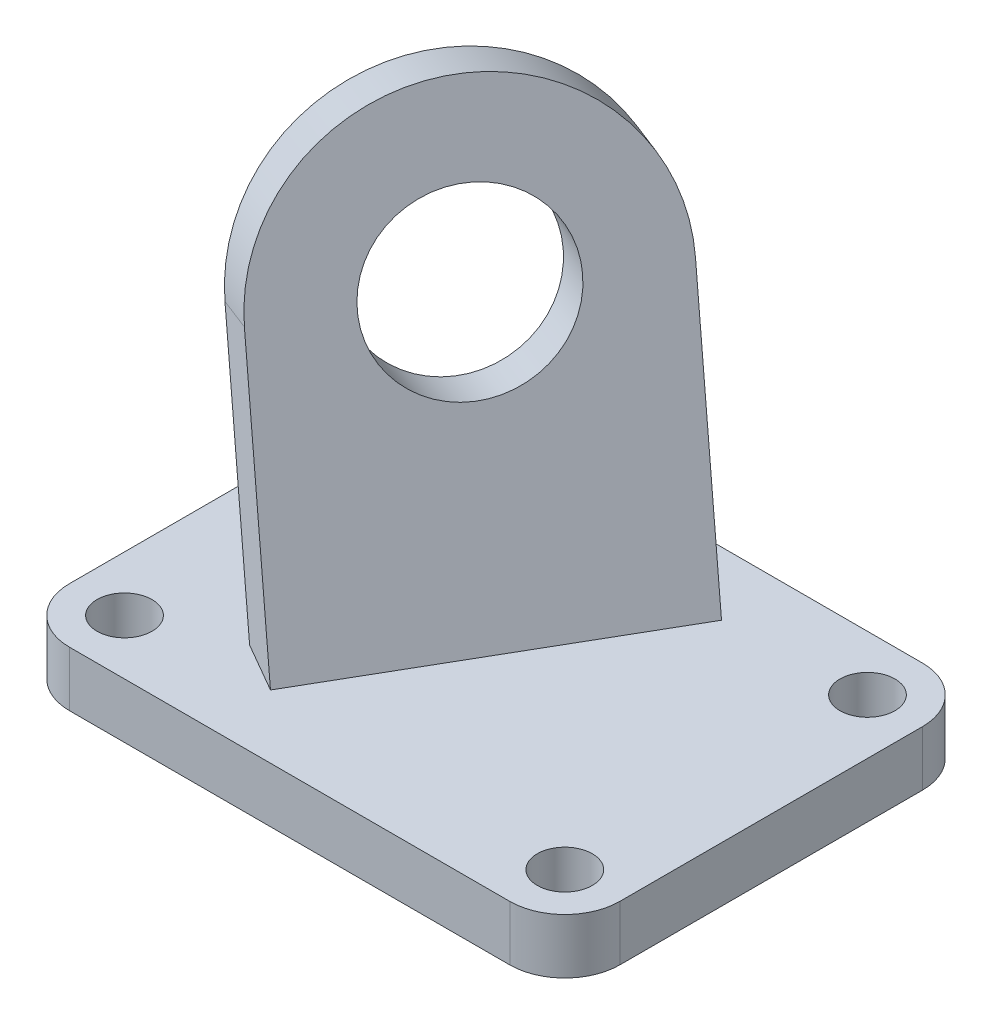
ISO-10303-21;
HEADER;
FILE_DESCRIPTION(('STEP AP214'),'2;1');
FILE_NAME('part.step','',(''),(''),'','','');
FILE_SCHEMA(('AUTOMOTIVE_DESIGN { 1 0 10303 214 1 1 1 1 }'));
ENDSEC;
DATA;
#1=APPLICATION_CONTEXT('core data for automotive mechanical design processes');
#2=APPLICATION_PROTOCOL_DEFINITION('international standard','automotive_design',2000,#1);
#3=PRODUCT_CONTEXT('',#1,'mechanical');
#4=PRODUCT('Part','Part','',(#3));
#5=PRODUCT_RELATED_PRODUCT_CATEGORY('part','',(#4));
#6=PRODUCT_DEFINITION_FORMATION('','',#4);
#7=PRODUCT_DEFINITION_CONTEXT('part definition',#1,'design');
#8=PRODUCT_DEFINITION('design','',#6,#7);
#9=PRODUCT_DEFINITION_SHAPE('','',#8);
#10=(LENGTH_UNIT() NAMED_UNIT(*) SI_UNIT(.MILLI.,.METRE.));
#11=(NAMED_UNIT(*) PLANE_ANGLE_UNIT() SI_UNIT($,.RADIAN.));
#12=(NAMED_UNIT(*) SI_UNIT($,.STERADIAN.) SOLID_ANGLE_UNIT());
#13=UNCERTAINTY_MEASURE_WITH_UNIT(LENGTH_MEASURE(1.E-05),#10,'distance_accuracy_value','');
#14=(GEOMETRIC_REPRESENTATION_CONTEXT(3) GLOBAL_UNCERTAINTY_ASSIGNED_CONTEXT((#13)) GLOBAL_UNIT_ASSIGNED_CONTEXT((#10,
#11,#12)) REPRESENTATION_CONTEXT('',''));
#15=CARTESIAN_POINT('',(0.,0.,0.));
#16=DIRECTION('',(0.,0.,1.));
#17=DIRECTION('',(1.,0.,0.));
#18=AXIS2_PLACEMENT_3D('',#15,#16,#17);
#19=CARTESIAN_POINT('',(-40.,-10.,-27.5));
#20=DIRECTION('',(0.,1.,0.));
#21=DIRECTION('',(0.,0.,1.));
#22=AXIS2_PLACEMENT_3D('',#19,#20,#21);
#23=CYLINDRICAL_SURFACE('',#22,10.);
#24=CARTESIAN_POINT('',(-40.,0.,-27.5));
#25=DIRECTION('',(0.,1.,0.));
#26=DIRECTION('',(0.,0.,-1.));
#27=AXIS2_PLACEMENT_3D('',#24,#25,#26);
#28=CIRCLE('',#27,10.);
#29=CARTESIAN_POINT('',(-39.9999999999999,0.,-37.5));
#30=VERTEX_POINT('',#29);
#31=CARTESIAN_POINT('',(-50.,0.,-27.4999999999999));
#32=VERTEX_POINT('',#31);
#33=EDGE_CURVE('E177',#30,#32,#28,.T.);
#34=ORIENTED_EDGE('',*,*,#33,.F.);
#35=DIRECTION('',(0.,1.,0.));
#36=VECTOR('',#35,1.);
#37=CARTESIAN_POINT('',(-39.9999999999999,-10.,-37.5));
#38=LINE('',#37,#36);
#39=CARTESIAN_POINT('',(-39.9999999999999,-10.,-37.5));
#40=VERTEX_POINT('',#39);
#41=EDGE_CURVE('E228',#40,#30,#38,.T.);
#42=ORIENTED_EDGE('',*,*,#41,.F.);
#43=CARTESIAN_POINT('',(-40.,-10.,-27.5));
#44=DIRECTION('',(0.,1.,0.));
#45=DIRECTION('',(0.,0.,-1.));
#46=AXIS2_PLACEMENT_3D('',#43,#44,#45);
#47=CIRCLE('',#46,10.);
#48=CARTESIAN_POINT('',(-50.,-10.,-27.4999999999999));
#49=VERTEX_POINT('',#48);
#50=EDGE_CURVE('E180',#40,#49,#47,.T.);
#51=ORIENTED_EDGE('',*,*,#50,.T.);
#52=DIRECTION('',(0.,1.,0.));
#53=VECTOR('',#52,1.);
#54=CARTESIAN_POINT('',(-50.,-10.,-27.4999999999999));
#55=LINE('',#54,#53);
#56=EDGE_CURVE('E205',#49,#32,#55,.T.);
#57=ORIENTED_EDGE('',*,*,#56,.T.);
#58=EDGE_LOOP('',(#34,#42,#51,#57));
#59=FACE_BOUND('',#58,.T.);
#60=ADVANCED_FACE('F33',(#59),#23,.T.);
#61=CARTESIAN_POINT('',(-39.9999999999999,-10.,-37.5));
#62=DIRECTION('',(0.,0.,-1.));
#63=DIRECTION('',(-1.,0.,0.));
#64=AXIS2_PLACEMENT_3D('',#61,#62,#63);
#65=PLANE('',#64);
#66=DIRECTION('',(-1.,0.,0.));
#67=VECTOR('',#66,1.);
#68=CARTESIAN_POINT('',(-39.9999999999999,0.,-37.5));
#69=LINE('',#68,#67);
#70=CARTESIAN_POINT('',(39.9999999999999,0.,-37.5));
#71=VERTEX_POINT('',#70);
#72=EDGE_CURVE('E184',#71,#30,#69,.T.);
#73=ORIENTED_EDGE('',*,*,#72,.F.);
#74=DIRECTION('',(0.,1.,0.));
#75=VECTOR('',#74,1.);
#76=CARTESIAN_POINT('',(39.9999999999999,-10.,-37.5));
#77=LINE('',#76,#75);
#78=CARTESIAN_POINT('',(39.9999999999999,-10.,-37.5));
#79=VERTEX_POINT('',#78);
#80=EDGE_CURVE('E230',#79,#71,#77,.T.);
#81=ORIENTED_EDGE('',*,*,#80,.F.);
#82=DIRECTION('',(-1.,0.,0.));
#83=VECTOR('',#82,1.);
#84=CARTESIAN_POINT('',(-39.9999999999999,-10.,-37.5));
#85=LINE('',#84,#83);
#86=EDGE_CURVE('E202',#79,#40,#85,.T.);
#87=ORIENTED_EDGE('',*,*,#86,.T.);
#88=ORIENTED_EDGE('',*,*,#41,.T.);
#89=EDGE_LOOP('',(#73,#81,#87,#88));
#90=FACE_BOUND('',#89,.T.);
#91=ADVANCED_FACE('F256',(#90),#65,.T.);
#92=CARTESIAN_POINT('',(40.,-10.,-27.5));
#93=DIRECTION('',(0.,1.,0.));
#94=DIRECTION('',(0.,0.,1.));
#95=AXIS2_PLACEMENT_3D('',#92,#93,#94);
#96=CYLINDRICAL_SURFACE('',#95,10.);
#97=CARTESIAN_POINT('',(40.,0.,-27.5));
#98=DIRECTION('',(0.,1.,0.));
#99=DIRECTION('',(0.,0.,1.));
#100=AXIS2_PLACEMENT_3D('',#97,#98,#99);
#101=CIRCLE('',#100,10.);
#102=CARTESIAN_POINT('',(50.,0.,-27.4999999999999));
#103=VERTEX_POINT('',#102);
#104=EDGE_CURVE('E223',#103,#71,#101,.T.);
#105=ORIENTED_EDGE('',*,*,#104,.F.);
#106=DIRECTION('',(0.,1.,0.));
#107=VECTOR('',#106,1.);
#108=CARTESIAN_POINT('',(50.,-10.,-27.4999999999999));
#109=LINE('',#108,#107);
#110=CARTESIAN_POINT('',(50.,-10.,-27.4999999999999));
#111=VERTEX_POINT('',#110);
#112=EDGE_CURVE('E232',#111,#103,#109,.T.);
#113=ORIENTED_EDGE('',*,*,#112,.F.);
#114=CARTESIAN_POINT('',(40.,-10.,-27.5));
#115=DIRECTION('',(0.,1.,0.));
#116=DIRECTION('',(0.,0.,1.));
#117=AXIS2_PLACEMENT_3D('',#114,#115,#116);
#118=CIRCLE('',#117,10.);
#119=EDGE_CURVE('E199',#111,#79,#118,.T.);
#120=ORIENTED_EDGE('',*,*,#119,.T.);
#121=ORIENTED_EDGE('',*,*,#80,.T.);
#122=EDGE_LOOP('',(#105,#113,#120,#121));
#123=FACE_BOUND('',#122,.T.);
#124=ADVANCED_FACE('F277',(#123),#96,.T.);
#125=CARTESIAN_POINT('',(50.,-10.,27.4999999999999));
#126=DIRECTION('',(1.,0.,0.));
#127=DIRECTION('',(0.,0.,-1.));
#128=AXIS2_PLACEMENT_3D('',#125,#126,#127);
#129=PLANE('',#128);
#130=DIRECTION('',(0.,0.,-1.));
#131=VECTOR('',#130,1.);
#132=CARTESIAN_POINT('',(50.,0.,27.4999999999999));
#133=LINE('',#132,#131);
#134=CARTESIAN_POINT('',(50.,0.,27.4999999999999));
#135=VERTEX_POINT('',#134);
#136=EDGE_CURVE('E220',#135,#103,#133,.T.);
#137=ORIENTED_EDGE('',*,*,#136,.F.);
#138=DIRECTION('',(0.,1.,0.));
#139=VECTOR('',#138,1.);
#140=CARTESIAN_POINT('',(50.,-10.,27.4999999999999));
#141=LINE('',#140,#139);
#142=CARTESIAN_POINT('',(50.,-10.,27.4999999999999));
#143=VERTEX_POINT('',#142);
#144=EDGE_CURVE('E234',#143,#135,#141,.T.);
#145=ORIENTED_EDGE('',*,*,#144,.F.);
#146=DIRECTION('',(0.,0.,-1.));
#147=VECTOR('',#146,1.);
#148=CARTESIAN_POINT('',(50.,-10.,27.4999999999999));
#149=LINE('',#148,#147);
#150=EDGE_CURVE('E196',#143,#111,#149,.T.);
#151=ORIENTED_EDGE('',*,*,#150,.T.);
#152=ORIENTED_EDGE('',*,*,#112,.T.);
#153=EDGE_LOOP('',(#137,#145,#151,#152));
#154=FACE_BOUND('',#153,.T.);
#155=ADVANCED_FACE('F275',(#154),#129,.T.);
#156=CARTESIAN_POINT('',(40.,-10.,27.5));
#157=DIRECTION('',(0.,1.,0.));
#158=DIRECTION('',(0.,0.,1.));
#159=AXIS2_PLACEMENT_3D('',#156,#157,#158);
#160=CYLINDRICAL_SURFACE('',#159,10.);
#161=CARTESIAN_POINT('',(40.,0.,27.5));
#162=DIRECTION('',(0.,1.,0.));
#163=DIRECTION('',(0.,0.,-1.));
#164=AXIS2_PLACEMENT_3D('',#161,#162,#163);
#165=CIRCLE('',#164,10.);
#166=CARTESIAN_POINT('',(39.9999999999999,0.,37.5));
#167=VERTEX_POINT('',#166);
#168=EDGE_CURVE('E217',#167,#135,#165,.T.);
#169=ORIENTED_EDGE('',*,*,#168,.F.);
#170=DIRECTION('',(0.,1.,0.));
#171=VECTOR('',#170,1.);
#172=CARTESIAN_POINT('',(39.9999999999999,-10.,37.5));
#173=LINE('',#172,#171);
#174=CARTESIAN_POINT('',(39.9999999999999,-10.,37.5));
#175=VERTEX_POINT('',#174);
#176=EDGE_CURVE('E236',#175,#167,#173,.T.);
#177=ORIENTED_EDGE('',*,*,#176,.F.);
#178=CARTESIAN_POINT('',(40.,-10.,27.5));
#179=DIRECTION('',(0.,1.,0.));
#180=DIRECTION('',(0.,0.,-1.));
#181=AXIS2_PLACEMENT_3D('',#178,#179,#180);
#182=CIRCLE('',#181,10.);
#183=EDGE_CURVE('E193',#175,#143,#182,.T.);
#184=ORIENTED_EDGE('',*,*,#183,.T.);
#185=ORIENTED_EDGE('',*,*,#144,.T.);
#186=EDGE_LOOP('',(#169,#177,#184,#185));
#187=FACE_BOUND('',#186,.T.);
#188=ADVANCED_FACE('F271',(#187),#160,.T.);
#189=CARTESIAN_POINT('',(-39.9999999999999,-10.,37.5));
#190=DIRECTION('',(0.,0.,1.));
#191=DIRECTION('',(1.,0.,0.));
#192=AXIS2_PLACEMENT_3D('',#189,#190,#191);
#193=PLANE('',#192);
#194=DIRECTION('',(1.,0.,0.));
#195=VECTOR('',#194,1.);
#196=CARTESIAN_POINT('',(-39.9999999999999,0.,37.5));
#197=LINE('',#196,#195);
#198=CARTESIAN_POINT('',(-39.9999999999999,0.,37.5));
#199=VERTEX_POINT('',#198);
#200=EDGE_CURVE('E214',#199,#167,#197,.T.);
#201=ORIENTED_EDGE('',*,*,#200,.F.);
#202=DIRECTION('',(0.,1.,0.));
#203=VECTOR('',#202,1.);
#204=CARTESIAN_POINT('',(-39.9999999999999,-10.,37.5));
#205=LINE('',#204,#203);
#206=CARTESIAN_POINT('',(-39.9999999999999,-10.,37.5));
#207=VERTEX_POINT('',#206);
#208=EDGE_CURVE('E238',#207,#199,#205,.T.);
#209=ORIENTED_EDGE('',*,*,#208,.F.);
#210=DIRECTION('',(1.,0.,0.));
#211=VECTOR('',#210,1.);
#212=CARTESIAN_POINT('',(-39.9999999999999,-10.,37.5));
#213=LINE('',#212,#211);
#214=EDGE_CURVE('E190',#207,#175,#213,.T.);
#215=ORIENTED_EDGE('',*,*,#214,.T.);
#216=ORIENTED_EDGE('',*,*,#176,.T.);
#217=EDGE_LOOP('',(#201,#209,#215,#216));
#218=FACE_BOUND('',#217,.T.);
#219=ADVANCED_FACE('F269',(#218),#193,.T.);
#220=CARTESIAN_POINT('',(-40.,-10.,27.5));
#221=DIRECTION('',(0.,1.,0.));
#222=DIRECTION('',(0.,0.,1.));
#223=AXIS2_PLACEMENT_3D('',#220,#221,#222);
#224=CYLINDRICAL_SURFACE('',#223,10.);
#225=CARTESIAN_POINT('',(-40.,0.,27.5));
#226=DIRECTION('',(0.,1.,0.));
#227=DIRECTION('',(0.,0.,-1.));
#228=AXIS2_PLACEMENT_3D('',#225,#226,#227);
#229=CIRCLE('',#228,10.);
#230=CARTESIAN_POINT('',(-50.,0.,27.4999999999999));
#231=VERTEX_POINT('',#230);
#232=EDGE_CURVE('E211',#231,#199,#229,.T.);
#233=ORIENTED_EDGE('',*,*,#232,.F.);
#234=DIRECTION('',(0.,1.,0.));
#235=VECTOR('',#234,1.);
#236=CARTESIAN_POINT('',(-50.,-10.,27.4999999999999));
#237=LINE('',#236,#235);
#238=CARTESIAN_POINT('',(-50.,-10.,27.4999999999999));
#239=VERTEX_POINT('',#238);
#240=EDGE_CURVE('E240',#239,#231,#237,.T.);
#241=ORIENTED_EDGE('',*,*,#240,.F.);
#242=CARTESIAN_POINT('',(-40.,-10.,27.5));
#243=DIRECTION('',(0.,1.,0.));
#244=DIRECTION('',(0.,0.,-1.));
#245=AXIS2_PLACEMENT_3D('',#242,#243,#244);
#246=CIRCLE('',#245,10.);
#247=EDGE_CURVE('E187',#239,#207,#246,.T.);
#248=ORIENTED_EDGE('',*,*,#247,.T.);
#249=ORIENTED_EDGE('',*,*,#208,.T.);
#250=EDGE_LOOP('',(#233,#241,#248,#249));
#251=FACE_BOUND('',#250,.T.);
#252=ADVANCED_FACE('F265',(#251),#224,.T.);
#253=CARTESIAN_POINT('',(-50.,-10.,27.4999999999999));
#254=DIRECTION('',(-1.,0.,0.));
#255=DIRECTION('',(0.,0.,1.));
#256=AXIS2_PLACEMENT_3D('',#253,#254,#255);
#257=PLANE('',#256);
#258=DIRECTION('',(0.,0.,1.));
#259=VECTOR('',#258,1.);
#260=CARTESIAN_POINT('',(-50.,0.,27.4999999999999));
#261=LINE('',#260,#259);
#262=EDGE_CURVE('E208',#32,#231,#261,.T.);
#263=ORIENTED_EDGE('',*,*,#262,.F.);
#264=ORIENTED_EDGE('',*,*,#56,.F.);
#265=DIRECTION('',(0.,0.,1.));
#266=VECTOR('',#265,1.);
#267=CARTESIAN_POINT('',(-50.,-10.,27.4999999999999));
#268=LINE('',#267,#266);
#269=EDGE_CURVE('E183',#49,#239,#268,.T.);
#270=ORIENTED_EDGE('',*,*,#269,.T.);
#271=ORIENTED_EDGE('',*,*,#240,.T.);
#272=EDGE_LOOP('',(#263,#264,#270,#271));
#273=FACE_BOUND('',#272,.T.);
#274=ADVANCED_FACE('F249',(#273),#257,.T.);
#275=CARTESIAN_POINT('',(-40.,-10.,-27.5));
#276=DIRECTION('',(0.,-1.,0.));
#277=DIRECTION('',(0.,0.,-1.));
#278=AXIS2_PLACEMENT_3D('',#275,#276,#277);
#279=PLANE('',#278);
#280=CARTESIAN_POINT('',(40.,-10.,27.5));
#281=DIRECTION('',(0.,1.,0.));
#282=DIRECTION('',(0.,0.,1.));
#283=AXIS2_PLACEMENT_3D('',#280,#281,#282);
#284=CIRCLE('',#283,5.);
#285=CARTESIAN_POINT('',(40.,-10.,32.5));
#286=VERTEX_POINT('',#285);
#287=EDGE_CURVE('E156',#286,#286,#284,.T.);
#288=ORIENTED_EDGE('',*,*,#287,.T.);
#289=EDGE_LOOP('',(#288));
#290=FACE_BOUND('',#289,.T.);
#291=CARTESIAN_POINT('',(-40.,-10.,27.5));
#292=DIRECTION('',(0.,1.,0.));
#293=DIRECTION('',(0.,0.,1.));
#294=AXIS2_PLACEMENT_3D('',#291,#292,#293);
#295=CIRCLE('',#294,5.);
#296=CARTESIAN_POINT('',(-40.,-10.,32.5));
#297=VERTEX_POINT('',#296);
#298=EDGE_CURVE('E162',#297,#297,#295,.T.);
#299=ORIENTED_EDGE('',*,*,#298,.T.);
#300=EDGE_LOOP('',(#299));
#301=FACE_BOUND('',#300,.T.);
#302=CARTESIAN_POINT('',(40.,-10.,-27.5));
#303=DIRECTION('',(0.,1.,0.));
#304=DIRECTION('',(0.,0.,1.));
#305=AXIS2_PLACEMENT_3D('',#302,#303,#304);
#306=CIRCLE('',#305,5.);
#307=CARTESIAN_POINT('',(40.,-10.,-22.5));
#308=VERTEX_POINT('',#307);
#309=EDGE_CURVE('E168',#308,#308,#306,.T.);
#310=ORIENTED_EDGE('',*,*,#309,.T.);
#311=EDGE_LOOP('',(#310));
#312=FACE_BOUND('',#311,.T.);
#313=CARTESIAN_POINT('',(-40.,-10.,-27.5));
#314=DIRECTION('',(0.,1.,0.));
#315=DIRECTION('',(0.,0.,1.));
#316=AXIS2_PLACEMENT_3D('',#313,#314,#315);
#317=CIRCLE('',#316,5.);
#318=CARTESIAN_POINT('',(-40.,-10.,-22.5));
#319=VERTEX_POINT('',#318);
#320=EDGE_CURVE('E174',#319,#319,#317,.T.);
#321=ORIENTED_EDGE('',*,*,#320,.T.);
#322=EDGE_LOOP('',(#321));
#323=FACE_BOUND('',#322,.T.);
#324=ORIENTED_EDGE('',*,*,#50,.F.);
#325=ORIENTED_EDGE('',*,*,#86,.F.);
#326=ORIENTED_EDGE('',*,*,#119,.F.);
#327=ORIENTED_EDGE('',*,*,#150,.F.);
#328=ORIENTED_EDGE('',*,*,#183,.F.);
#329=ORIENTED_EDGE('',*,*,#214,.F.);
#330=ORIENTED_EDGE('',*,*,#247,.F.);
#331=ORIENTED_EDGE('',*,*,#269,.F.);
#332=EDGE_LOOP('',(#324,#325,#326,#327,#328,#329,#330,#331));
#333=FACE_BOUND('',#332,.T.);
#334=ADVANCED_FACE('F259',(#290,#301,#312,#323,#333),#279,.T.);
#335=CARTESIAN_POINT('',(-40.,0.,-27.5));
#336=DIRECTION('',(0.,-1.,0.));
#337=DIRECTION('',(0.,0.,-1.));
#338=AXIS2_PLACEMENT_3D('',#335,#336,#337);
#339=PLANE('',#338);
#340=DIRECTION('',(0.500000000000001,0.,-0.866025403784438));
#341=VECTOR('',#340,1.);
#342=CARTESIAN_POINT('',(-7.05790541964452,0.,-8.4808728263616));
#343=LINE('',#342,#341);
#344=CARTESIAN_POINT('',(-23.9657547216806,0.,20.8043812114827));
#345=VERTEX_POINT('',#344);
#346=CARTESIAN_POINT('',(6.03424527831949,0.,-31.1571430155836));
#347=VERTEX_POINT('',#346);
#348=EDGE_CURVE('E40',#345,#347,#343,.T.);
#349=ORIENTED_EDGE('',*,*,#348,.T.);
#350=DIRECTION('',(0.866025403784438,0.,0.500000000000001));
#351=VECTOR('',#350,1.);
#352=CARTESIAN_POINT('',(-26.907849302036,0.,-50.176270189222));
#353=LINE('',#352,#351);
#354=CARTESIAN_POINT('',(15.,0.,-25.9807621135331));
#355=VERTEX_POINT('',#354);
#356=EDGE_CURVE('E11',#347,#355,#353,.T.);
#357=ORIENTED_EDGE('',*,*,#356,.T.);
#358=DIRECTION('',(0.500000000000001,0.,-0.866025403784438));
#359=VECTOR('',#358,1.);
#360=CARTESIAN_POINT('',(-15.,0.,25.9807621135332));
#361=LINE('',#360,#359);
#362=CARTESIAN_POINT('',(-15.,0.,25.9807621135332));
#363=VERTEX_POINT('',#362);
#364=EDGE_CURVE('E141',#363,#355,#361,.T.);
#365=ORIENTED_EDGE('',*,*,#364,.F.);
#366=DIRECTION('',(-0.866025403784438,0.,-0.500000000000001));
#367=VECTOR('',#366,1.);
#368=CARTESIAN_POINT('',(-56.9078493020361,0.,1.78525403784432));
#369=LINE('',#368,#367);
#370=EDGE_CURVE('E50',#363,#345,#369,.T.);
#371=ORIENTED_EDGE('',*,*,#370,.T.);
#372=EDGE_LOOP('',(#349,#357,#365,#371));
#373=FACE_BOUND('',#372,.T.);
#374=CARTESIAN_POINT('',(40.,0.,27.5));
#375=DIRECTION('',(0.,1.,0.));
#376=DIRECTION('',(0.,0.,1.));
#377=AXIS2_PLACEMENT_3D('',#374,#375,#376);
#378=CIRCLE('',#377,5.);
#379=CARTESIAN_POINT('',(40.,0.,32.5));
#380=VERTEX_POINT('',#379);
#381=EDGE_CURVE('E154',#380,#380,#378,.T.);
#382=ORIENTED_EDGE('',*,*,#381,.F.);
#383=EDGE_LOOP('',(#382));
#384=FACE_BOUND('',#383,.T.);
#385=CARTESIAN_POINT('',(-40.,0.,27.5));
#386=DIRECTION('',(0.,1.,0.));
#387=DIRECTION('',(0.,0.,1.));
#388=AXIS2_PLACEMENT_3D('',#385,#386,#387);
#389=CIRCLE('',#388,5.);
#390=CARTESIAN_POINT('',(-40.,0.,32.5));
#391=VERTEX_POINT('',#390);
#392=EDGE_CURVE('E159',#391,#391,#389,.T.);
#393=ORIENTED_EDGE('',*,*,#392,.F.);
#394=EDGE_LOOP('',(#393));
#395=FACE_BOUND('',#394,.T.);
#396=CARTESIAN_POINT('',(40.,0.,-27.5));
#397=DIRECTION('',(0.,1.,0.));
#398=DIRECTION('',(0.,0.,1.));
#399=AXIS2_PLACEMENT_3D('',#396,#397,#398);
#400=CIRCLE('',#399,5.);
#401=CARTESIAN_POINT('',(40.,0.,-22.5));
#402=VERTEX_POINT('',#401);
#403=EDGE_CURVE('E165',#402,#402,#400,.T.);
#404=ORIENTED_EDGE('',*,*,#403,.F.);
#405=EDGE_LOOP('',(#404));
#406=FACE_BOUND('',#405,.T.);
#407=CARTESIAN_POINT('',(-40.,0.,-27.5));
#408=DIRECTION('',(0.,1.,0.));
#409=DIRECTION('',(0.,0.,1.));
#410=AXIS2_PLACEMENT_3D('',#407,#408,#409);
#411=CIRCLE('',#410,5.);
#412=CARTESIAN_POINT('',(-40.,0.,-22.5));
#413=VERTEX_POINT('',#412);
#414=EDGE_CURVE('E171',#413,#413,#411,.T.);
#415=ORIENTED_EDGE('',*,*,#414,.F.);
#416=EDGE_LOOP('',(#415));
#417=FACE_BOUND('',#416,.T.);
#418=ORIENTED_EDGE('',*,*,#33,.T.);
#419=ORIENTED_EDGE('',*,*,#262,.T.);
#420=ORIENTED_EDGE('',*,*,#232,.T.);
#421=ORIENTED_EDGE('',*,*,#200,.T.);
#422=ORIENTED_EDGE('',*,*,#168,.T.);
#423=ORIENTED_EDGE('',*,*,#136,.T.);
#424=ORIENTED_EDGE('',*,*,#104,.T.);
#425=ORIENTED_EDGE('',*,*,#72,.T.);
#426=EDGE_LOOP('',(#418,#419,#420,#421,#422,#423,#424,#425));
#427=FACE_BOUND('',#426,.T.);
#428=ADVANCED_FACE('F252',(#373,#384,#395,#406,#417,#427),#339,.F.);
#429=CARTESIAN_POINT('',(-40.,-10.,-27.5));
#430=DIRECTION('',(0.,1.,0.));
#431=DIRECTION('',(0.,0.,1.));
#432=AXIS2_PLACEMENT_3D('',#429,#430,#431);
#433=CYLINDRICAL_SURFACE('',#432,5.);
#434=ORIENTED_EDGE('',*,*,#320,.F.);
#435=EDGE_LOOP('',(#434));
#436=FACE_BOUND('',#435,.T.);
#437=ORIENTED_EDGE('',*,*,#414,.T.);
#438=EDGE_LOOP('',(#437));
#439=FACE_BOUND('',#438,.T.);
#440=ADVANCED_FACE('F350',(#436,#439),#433,.F.);
#441=CARTESIAN_POINT('',(40.,-10.,-27.5));
#442=DIRECTION('',(0.,1.,0.));
#443=DIRECTION('',(0.,0.,1.));
#444=AXIS2_PLACEMENT_3D('',#441,#442,#443);
#445=CYLINDRICAL_SURFACE('',#444,5.);
#446=ORIENTED_EDGE('',*,*,#309,.F.);
#447=EDGE_LOOP('',(#446));
#448=FACE_BOUND('',#447,.T.);
#449=ORIENTED_EDGE('',*,*,#403,.T.);
#450=EDGE_LOOP('',(#449));
#451=FACE_BOUND('',#450,.T.);
#452=ADVANCED_FACE('F355',(#448,#451),#445,.F.);
#453=CARTESIAN_POINT('',(-40.,-10.,27.5));
#454=DIRECTION('',(0.,1.,0.));
#455=DIRECTION('',(0.,0.,1.));
#456=AXIS2_PLACEMENT_3D('',#453,#454,#455);
#457=CYLINDRICAL_SURFACE('',#456,5.);
#458=ORIENTED_EDGE('',*,*,#298,.F.);
#459=EDGE_LOOP('',(#458));
#460=FACE_BOUND('',#459,.T.);
#461=ORIENTED_EDGE('',*,*,#392,.T.);
#462=EDGE_LOOP('',(#461));
#463=FACE_BOUND('',#462,.T.);
#464=ADVANCED_FACE('F365',(#460,#463),#457,.F.);
#465=CARTESIAN_POINT('',(40.,-10.,27.5));
#466=DIRECTION('',(0.,1.,0.));
#467=DIRECTION('',(0.,0.,1.));
#468=AXIS2_PLACEMENT_3D('',#465,#466,#467);
#469=CYLINDRICAL_SURFACE('',#468,5.);
#470=ORIENTED_EDGE('',*,*,#287,.F.);
#471=EDGE_LOOP('',(#470));
#472=FACE_BOUND('',#471,.T.);
#473=ORIENTED_EDGE('',*,*,#381,.T.);
#474=EDGE_LOOP('',(#473));
#475=FACE_BOUND('',#474,.T.);
#476=ADVANCED_FACE('F375',(#472,#475),#469,.F.);
#477=CARTESIAN_POINT('',(6.63483696262195,-2.58819045102521,-30.8103912449785));
#478=DIRECTION('',(0.500000000000001,0.,-0.866025403784438));
#479=DIRECTION('',(-0.866025403784438,0.,-0.500000000000001));
#480=AXIS2_PLACEMENT_3D('',#477,#478,#479);
#481=PLANE('',#480);
#482=ORIENTED_EDGE('',*,*,#356,.F.);
#483=DIRECTION('',(-0.224143868042014,0.965925826289068,-0.129409522551261));
#484=VECTOR('',#483,1.);
#485=CARTESIAN_POINT('',(6.63483696262195,-2.58819045102521,-30.8103912449785));
#486=LINE('',#485,#484);
#487=CARTESIAN_POINT('',(-4.57235643947874,45.7081008634282,-37.2808673725415));
#488=VERTEX_POINT('',#487);
#489=EDGE_CURVE('E128',#347,#488,#486,.T.);
#490=ORIENTED_EDGE('',*,*,#489,.T.);
#491=DIRECTION('',(0.836516303737807,0.258819045102521,0.482962913144535));
#492=VECTOR('',#491,1.);
#493=CARTESIAN_POINT('',(-4.57235643947874,45.7081008634282,-37.2808673725415));
#494=LINE('',#493,#492);
#495=CARTESIAN_POINT('',(3.79280659789934,48.2962913144534,-32.4512382410962));
#496=VERTEX_POINT('',#495);
#497=EDGE_CURVE('E127',#488,#496,#494,.T.);
#498=ORIENTED_EDGE('',*,*,#497,.T.);
#499=DIRECTION('',(-0.224143868042014,0.965925826289068,-0.129409522551261));
#500=VECTOR('',#499,1.);
#501=CARTESIAN_POINT('',(15.,0.,-25.9807621135331));
#502=LINE('',#501,#500);
#503=EDGE_CURVE('E138',#355,#496,#502,.T.);
#504=ORIENTED_EDGE('',*,*,#503,.F.);
#505=EDGE_LOOP('',(#482,#490,#498,#504));
#506=FACE_BOUND('',#505,.T.);
#507=ADVANCED_FACE('F385',(#506),#481,.T.);
#508=CARTESIAN_POINT('',(-34.5723564394788,45.7081008634282,14.6806568545248));
#509=DIRECTION('',(-0.500000000000001,0.,0.866025403784438));
#510=DIRECTION('',(0.866025403784438,0.,0.500000000000001));
#511=AXIS2_PLACEMENT_3D('',#508,#509,#510);
#512=PLANE('',#511);
#513=ORIENTED_EDGE('',*,*,#370,.F.);
#514=DIRECTION('',(0.224143868042014,-0.965925826289068,0.129409522551261));
#515=VECTOR('',#514,1.);
#516=CARTESIAN_POINT('',(-26.2071934021007,48.2962913144534,19.5102859859701));
#517=LINE('',#516,#515);
#518=CARTESIAN_POINT('',(-26.2071934021007,48.2962913144534,19.5102859859701));
#519=VERTEX_POINT('',#518);
#520=EDGE_CURVE('E122',#519,#363,#517,.T.);
#521=ORIENTED_EDGE('',*,*,#520,.F.);
#522=DIRECTION('',(0.836516303737807,0.258819045102521,0.482962913144535));
#523=VECTOR('',#522,1.);
#524=CARTESIAN_POINT('',(-34.5723564394788,45.7081008634282,14.6806568545248));
#525=LINE('',#524,#523);
#526=CARTESIAN_POINT('',(-34.5723564394788,45.7081008634282,14.6806568545248));
#527=VERTEX_POINT('',#526);
#528=EDGE_CURVE('E117',#527,#519,#525,.T.);
#529=ORIENTED_EDGE('',*,*,#528,.F.);
#530=DIRECTION('',(0.224143868042014,-0.965925826289068,0.129409522551261));
#531=VECTOR('',#530,1.);
#532=CARTESIAN_POINT('',(-34.5723564394788,45.7081008634282,14.6806568545248));
#533=LINE('',#532,#531);
#534=EDGE_CURVE('E120',#527,#345,#533,.T.);
#535=ORIENTED_EDGE('',*,*,#534,.T.);
#536=EDGE_LOOP('',(#513,#521,#529,#535));
#537=FACE_BOUND('',#536,.T.);
#538=ADVANCED_FACE('F119',(#537),#512,.T.);
#539=CARTESIAN_POINT('',(-19.5723564394788,45.7081008634282,-11.3001052590084));
#540=DIRECTION('',(-0.836516303737807,-0.258819045102521,-0.482962913144535));
#541=DIRECTION('',(-0.500000000000001,0.,0.866025403784438));
#542=AXIS2_PLACEMENT_3D('',#539,#540,#541);
#543=PLANE('',#542);
#544=CARTESIAN_POINT('',(-19.5723564394788,45.7081008634282,-11.3001052590084));
#545=DIRECTION('',(0.836516303737807,0.258819045102521,0.482962913144535));
#546=DIRECTION('',(0.500000000000001,0.,-0.866025403784438));
#547=AXIS2_PLACEMENT_3D('',#544,#545,#546);
#548=CIRCLE('',#547,15.);
#549=CARTESIAN_POINT('',(-12.0723564394788,45.7081008634282,-24.290486315775));
#550=VERTEX_POINT('',#549);
#551=EDGE_CURVE('E150',#550,#550,#548,.T.);
#552=ORIENTED_EDGE('',*,*,#551,.T.);
#553=EDGE_LOOP('',(#552));
#554=FACE_BOUND('',#553,.T.);
#555=ORIENTED_EDGE('',*,*,#348,.F.);
#556=ORIENTED_EDGE('',*,*,#534,.F.);
#557=CARTESIAN_POINT('',(-19.5723564394788,45.7081008634282,-11.3001052590084));
#558=DIRECTION('',(0.836516303737807,0.258819045102521,0.482962913144535));
#559=DIRECTION('',(-0.500000000000001,0.,0.866025403784438));
#560=AXIS2_PLACEMENT_3D('',#557,#558,#559);
#561=CIRCLE('',#560,30.);
#562=EDGE_CURVE('E134',#488,#527,#561,.T.);
#563=ORIENTED_EDGE('',*,*,#562,.F.);
#564=ORIENTED_EDGE('',*,*,#489,.F.);
#565=EDGE_LOOP('',(#555,#556,#563,#564));
#566=FACE_BOUND('',#565,.T.);
#567=ADVANCED_FACE('F132',(#554,#566),#543,.T.);
#568=CARTESIAN_POINT('',(-19.5723564394788,45.7081008634282,-11.3001052590084));
#569=DIRECTION('',(0.836516303737807,0.258819045102521,0.482962913144535));
#570=DIRECTION('',(0.500000000000001,0.,-0.866025403784438));
#571=AXIS2_PLACEMENT_3D('',#568,#569,#570);
#572=CYLINDRICAL_SURFACE('',#571,30.);
#573=CARTESIAN_POINT('',(-11.2071934021007,48.2962913144534,-6.47047612756304));
#574=DIRECTION('',(0.836516303737807,0.258819045102521,0.482962913144535));
#575=DIRECTION('',(-0.500000000000001,0.,0.866025403784438));
#576=AXIS2_PLACEMENT_3D('',#573,#574,#575);
#577=CIRCLE('',#576,30.);
#578=EDGE_CURVE('E148',#496,#519,#577,.T.);
#579=ORIENTED_EDGE('',*,*,#578,.F.);
#580=ORIENTED_EDGE('',*,*,#497,.F.);
#581=ORIENTED_EDGE('',*,*,#562,.T.);
#582=ORIENTED_EDGE('',*,*,#528,.T.);
#583=EDGE_LOOP('',(#579,#580,#581,#582));
#584=FACE_BOUND('',#583,.T.);
#585=ADVANCED_FACE('F137',(#584),#572,.T.);
#586=CARTESIAN_POINT('',(-11.2071934021007,48.2962913144534,-6.47047612756304));
#587=DIRECTION('',(-0.836516303737807,-0.258819045102521,-0.482962913144535));
#588=DIRECTION('',(-0.500000000000001,0.,0.866025403784438));
#589=AXIS2_PLACEMENT_3D('',#586,#587,#588);
#590=PLANE('',#589);
#591=CARTESIAN_POINT('',(-11.2071934021007,48.2962913144534,-6.47047612756304));
#592=DIRECTION('',(0.836516303737807,0.258819045102521,0.482962913144535));
#593=DIRECTION('',(0.500000000000001,0.,-0.866025403784438));
#594=AXIS2_PLACEMENT_3D('',#591,#592,#593);
#595=CIRCLE('',#594,15.);
#596=CARTESIAN_POINT('',(-3.70719340210068,48.2962913144534,-19.4608571843296));
#597=VERTEX_POINT('',#596);
#598=EDGE_CURVE('E144',#597,#597,#595,.T.);
#599=ORIENTED_EDGE('',*,*,#598,.F.);
#600=EDGE_LOOP('',(#599));
#601=FACE_BOUND('',#600,.T.);
#602=ORIENTED_EDGE('',*,*,#578,.T.);
#603=ORIENTED_EDGE('',*,*,#520,.T.);
#604=ORIENTED_EDGE('',*,*,#364,.T.);
#605=ORIENTED_EDGE('',*,*,#503,.T.);
#606=EDGE_LOOP('',(#602,#603,#604,#605));
#607=FACE_BOUND('',#606,.T.);
#608=ADVANCED_FACE('F427',(#601,#607),#590,.F.);
#609=CARTESIAN_POINT('',(-19.5723564394788,45.7081008634282,-11.3001052590084));
#610=DIRECTION('',(0.836516303737807,0.258819045102521,0.482962913144535));
#611=DIRECTION('',(0.500000000000001,0.,-0.866025403784438));
#612=AXIS2_PLACEMENT_3D('',#609,#610,#611);
#613=CYLINDRICAL_SURFACE('',#612,15.);
#614=ORIENTED_EDGE('',*,*,#551,.F.);
#615=EDGE_LOOP('',(#614));
#616=FACE_BOUND('',#615,.T.);
#617=ORIENTED_EDGE('',*,*,#598,.T.);
#618=EDGE_LOOP('',(#617));
#619=FACE_BOUND('',#618,.T.);
#620=ADVANCED_FACE('F436',(#616,#619),#613,.F.);
#621=CLOSED_SHELL('',(#60,#91,#124,#155,#188,#219,#252,#274,#334,#428,#440,#452,#464,#476,#507,
#538,#567,#585,#608,#620));
#622=MANIFOLD_SOLID_BREP('B2',#621);
#623=ADVANCED_BREP_SHAPE_REPRESENTATION('',(#18,#622),#14);
#624=SHAPE_DEFINITION_REPRESENTATION(#9,#623);
ENDSEC;
END-ISO-10303-21;
